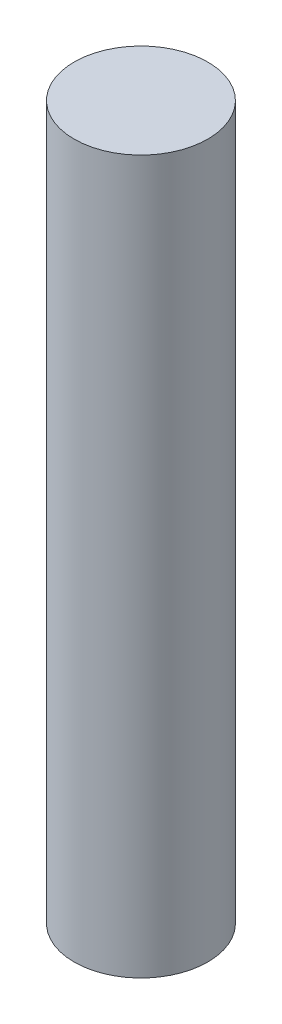
ISO-10303-21;
HEADER;
FILE_DESCRIPTION(('STEP AP214'),'2;1');
FILE_NAME('part.step','',(''),(''),'','','');
FILE_SCHEMA(('AUTOMOTIVE_DESIGN { 1 0 10303 214 1 1 1 1 }'));
ENDSEC;
DATA;
#1=APPLICATION_CONTEXT('core data for automotive mechanical design processes');
#2=APPLICATION_PROTOCOL_DEFINITION('international standard','automotive_design',2000,#1);
#3=PRODUCT_CONTEXT('',#1,'mechanical');
#4=PRODUCT('Part','Part','',(#3));
#5=PRODUCT_RELATED_PRODUCT_CATEGORY('part','',(#4));
#6=PRODUCT_DEFINITION_FORMATION('','',#4);
#7=PRODUCT_DEFINITION_CONTEXT('part definition',#1,'design');
#8=PRODUCT_DEFINITION('design','',#6,#7);
#9=PRODUCT_DEFINITION_SHAPE('','',#8);
#10=(LENGTH_UNIT() NAMED_UNIT(*) SI_UNIT(.MILLI.,.METRE.));
#11=(NAMED_UNIT(*) PLANE_ANGLE_UNIT() SI_UNIT($,.RADIAN.));
#12=(NAMED_UNIT(*) SI_UNIT($,.STERADIAN.) SOLID_ANGLE_UNIT());
#13=UNCERTAINTY_MEASURE_WITH_UNIT(LENGTH_MEASURE(1.E-05),#10,'distance_accuracy_value','');
#14=(GEOMETRIC_REPRESENTATION_CONTEXT(3) GLOBAL_UNCERTAINTY_ASSIGNED_CONTEXT((#13)) GLOBAL_UNIT_ASSIGNED_CONTEXT((#10,
#11,#12)) REPRESENTATION_CONTEXT('',''));
#15=CARTESIAN_POINT('',(0.,0.,0.));
#16=DIRECTION('',(0.,0.,1.));
#17=DIRECTION('',(1.,0.,0.));
#18=AXIS2_PLACEMENT_3D('',#15,#16,#17);
#19=CARTESIAN_POINT('',(0.,25.4,0.));
#20=DIRECTION('',(0.,-1.,0.));
#21=DIRECTION('',(0.,0.,-1.));
#22=AXIS2_PLACEMENT_3D('',#19,#20,#21);
#23=CYLINDRICAL_SURFACE('',#22,2.38125);
#24=CARTESIAN_POINT('',(0.,25.4,0.));
#25=DIRECTION('',(0.,1.,0.));
#26=DIRECTION('',(0.,0.,1.));
#27=AXIS2_PLACEMENT_3D('',#24,#25,#26);
#28=CIRCLE('',#27,2.38125);
#29=CARTESIAN_POINT('',(0.,25.4,2.38125));
#30=VERTEX_POINT('',#29);
#31=EDGE_CURVE('E10',#30,#30,#28,.T.);
#32=ORIENTED_EDGE('',*,*,#31,.F.);
#33=EDGE_LOOP('',(#32));
#34=FACE_BOUND('',#33,.T.);
#35=CARTESIAN_POINT('',(0.,0.,0.));
#36=DIRECTION('',(0.,1.,0.));
#37=DIRECTION('',(0.,0.,1.));
#38=AXIS2_PLACEMENT_3D('',#35,#36,#37);
#39=CIRCLE('',#38,2.38125);
#40=CARTESIAN_POINT('',(0.,0.,2.38125));
#41=VERTEX_POINT('',#40);
#42=EDGE_CURVE('E34',#41,#41,#39,.T.);
#43=ORIENTED_EDGE('',*,*,#42,.T.);
#44=EDGE_LOOP('',(#43));
#45=FACE_BOUND('',#44,.T.);
#46=ADVANCED_FACE('F31',(#34,#45),#23,.T.);
#47=CARTESIAN_POINT('',(0.,25.4,0.));
#48=DIRECTION('',(0.,1.,0.));
#49=DIRECTION('',(0.,0.,1.));
#50=AXIS2_PLACEMENT_3D('',#47,#48,#49);
#51=PLANE('',#50);
#52=ORIENTED_EDGE('',*,*,#31,.T.);
#53=EDGE_LOOP('',(#52));
#54=FACE_BOUND('',#53,.T.);
#55=ADVANCED_FACE('F46',(#54),#51,.T.);
#56=CARTESIAN_POINT('',(0.,0.,0.));
#57=DIRECTION('',(0.,1.,0.));
#58=DIRECTION('',(0.,0.,1.));
#59=AXIS2_PLACEMENT_3D('',#56,#57,#58);
#60=PLANE('',#59);
#61=ORIENTED_EDGE('',*,*,#42,.F.);
#62=EDGE_LOOP('',(#61));
#63=FACE_BOUND('',#62,.T.);
#64=ADVANCED_FACE('F44',(#63),#60,.F.);
#65=CLOSED_SHELL('',(#46,#55,#64));
#66=MANIFOLD_SOLID_BREP('B2',#65);
#67=ADVANCED_BREP_SHAPE_REPRESENTATION('',(#18,#66),#14);
#68=SHAPE_DEFINITION_REPRESENTATION(#9,#67);
ENDSEC;
END-ISO-10303-21;
